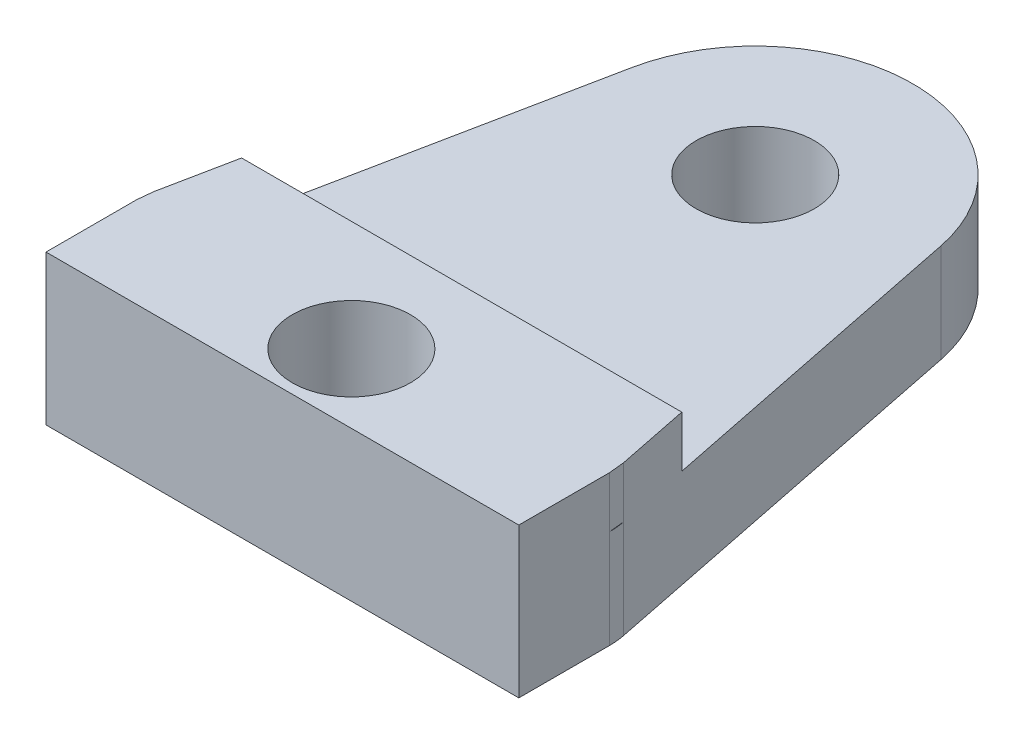
ISO-10303-21;
HEADER;
FILE_DESCRIPTION(('STEP AP214'),'2;1');
FILE_NAME('part.step','',(''),(''),'','','');
FILE_SCHEMA(('AUTOMOTIVE_DESIGN { 1 0 10303 214 1 1 1 1 }'));
ENDSEC;
DATA;
#1=APPLICATION_CONTEXT('core data for automotive mechanical design processes');
#2=APPLICATION_PROTOCOL_DEFINITION('international standard','automotive_design',2000,#1);
#3=PRODUCT_CONTEXT('',#1,'mechanical');
#4=PRODUCT('Part','Part','',(#3));
#5=PRODUCT_RELATED_PRODUCT_CATEGORY('part','',(#4));
#6=PRODUCT_DEFINITION_FORMATION('','',#4);
#7=PRODUCT_DEFINITION_CONTEXT('part definition',#1,'design');
#8=PRODUCT_DEFINITION('design','',#6,#7);
#9=PRODUCT_DEFINITION_SHAPE('','',#8);
#10=(LENGTH_UNIT() NAMED_UNIT(*) SI_UNIT(.MILLI.,.METRE.));
#11=(NAMED_UNIT(*) PLANE_ANGLE_UNIT() SI_UNIT($,.RADIAN.));
#12=(NAMED_UNIT(*) SI_UNIT($,.STERADIAN.) SOLID_ANGLE_UNIT());
#13=UNCERTAINTY_MEASURE_WITH_UNIT(LENGTH_MEASURE(1.E-05),#10,'distance_accuracy_value','');
#14=(GEOMETRIC_REPRESENTATION_CONTEXT(3) GLOBAL_UNCERTAINTY_ASSIGNED_CONTEXT((#13)) GLOBAL_UNIT_ASSIGNED_CONTEXT((#10,
#11,#12)) REPRESENTATION_CONTEXT('',''));
#15=CARTESIAN_POINT('',(0.,0.,0.));
#16=DIRECTION('',(0.,0.,1.));
#17=DIRECTION('',(1.,0.,0.));
#18=AXIS2_PLACEMENT_3D('',#15,#16,#17);
#19=CARTESIAN_POINT('',(6.,2.5,-12.));
#20=DIRECTION('',(0.,1.,0.));
#21=DIRECTION('',(0.,0.,1.));
#22=AXIS2_PLACEMENT_3D('',#19,#20,#21);
#23=PLANE('',#22);
#24=DIRECTION('',(-1.,0.,0.));
#25=VECTOR('',#24,1.);
#26=CARTESIAN_POINT('',(0.414141414141416,2.5,-4.55));
#27=LINE('',#26,#25);
#28=CARTESIAN_POINT('',(11.5858585858586,2.5,-4.55));
#29=VERTEX_POINT('',#28);
#30=CARTESIAN_POINT('',(0.414141414141416,2.5,-4.55));
#31=VERTEX_POINT('',#30);
#32=EDGE_CURVE('E50',#29,#31,#27,.T.);
#33=ORIENTED_EDGE('',*,*,#32,.F.);
#34=DIRECTION('',(-0.198019801980198,0.,-0.98019801980198));
#35=VECTOR('',#34,1.);
#36=CARTESIAN_POINT('',(12.,2.5,-2.5));
#37=LINE('',#36,#35);
#38=CARTESIAN_POINT('',(9.92079207920792,2.5,-12.7920792079208));
#39=VERTEX_POINT('',#38);
#40=EDGE_CURVE('E167',#29,#39,#37,.T.);
#41=ORIENTED_EDGE('',*,*,#40,.T.);
#42=CARTESIAN_POINT('',(6.,2.5,-12.));
#43=DIRECTION('',(0.,1.,0.));
#44=DIRECTION('',(0.,0.,1.));
#45=AXIS2_PLACEMENT_3D('',#42,#43,#44);
#46=CIRCLE('',#45,4.);
#47=CARTESIAN_POINT('',(2.07920792079208,2.5,-12.7920792079208));
#48=VERTEX_POINT('',#47);
#49=EDGE_CURVE('E164',#39,#48,#46,.T.);
#50=ORIENTED_EDGE('',*,*,#49,.T.);
#51=DIRECTION('',(-0.198019801980198,0.,0.98019801980198));
#52=VECTOR('',#51,1.);
#53=CARTESIAN_POINT('',(2.07920792079208,2.5,-12.7920792079208));
#54=LINE('',#53,#52);
#55=EDGE_CURVE('E55',#48,#31,#54,.T.);
#56=ORIENTED_EDGE('',*,*,#55,.T.);
#57=EDGE_LOOP('',(#33,#41,#50,#56));
#58=FACE_BOUND('',#57,.T.);
#59=CARTESIAN_POINT('',(6.,2.5,-12.));
#60=DIRECTION('',(0.,1.,0.));
#61=DIRECTION('',(0.,0.,1.));
#62=AXIS2_PLACEMENT_3D('',#59,#60,#61);
#63=CIRCLE('',#62,1.5);
#64=CARTESIAN_POINT('',(6.,2.5,-10.5));
#65=VERTEX_POINT('',#64);
#66=EDGE_CURVE('E153',#65,#65,#63,.T.);
#67=ORIENTED_EDGE('',*,*,#66,.F.);
#68=EDGE_LOOP('',(#67));
#69=FACE_BOUND('',#68,.T.);
#70=ADVANCED_FACE('F33',(#58,#69),#23,.T.);
#71=DIRECTION('',(-0.099503719020999,0.,-0.995037190209989));
#72=VECTOR('',#71,1.);
#73=CARTESIAN_POINT('',(12.,2.5,-2.3));
#74=LINE('',#73,#72);
#75=CARTESIAN_POINT('',(12.,2.5,-2.3));
#76=VERTEX_POINT('',#75);
#77=CARTESIAN_POINT('',(11.960396039604,2.5,-2.6960396039604));
#78=VERTEX_POINT('',#77);
#79=EDGE_CURVE('E173',#76,#78,#74,.T.);
#80=ORIENTED_EDGE('',*,*,#79,.F.);
#81=CARTESIAN_POINT('',(10.,2.5,-2.3));
#82=DIRECTION('',(0.,1.,0.));
#83=DIRECTION('',(0.,0.,1.));
#84=AXIS2_PLACEMENT_3D('',#81,#82,#83);
#85=CIRCLE('',#84,2.);
#86=EDGE_CURVE('E203',#76,#78,#85,.T.);
#87=ORIENTED_EDGE('',*,*,#86,.T.);
#88=EDGE_LOOP('',(#80,#87));
#89=FACE_BOUND('',#88,.T.);
#90=ADVANCED_FACE('F288',(#89),#23,.T.);
#91=DIRECTION('',(-0.0995037190210002,0.,0.995037190209989));
#92=VECTOR('',#91,1.);
#93=CARTESIAN_POINT('',(0.0396039603960401,2.5,-2.69603960396039));
#94=LINE('',#93,#92);
#95=CARTESIAN_POINT('',(0.0396039603960401,2.5,-2.69603960396039));
#96=VERTEX_POINT('',#95);
#97=CARTESIAN_POINT('',(0.,2.5,-2.29999999999999));
#98=VERTEX_POINT('',#97);
#99=EDGE_CURVE('E255',#96,#98,#94,.T.);
#100=ORIENTED_EDGE('',*,*,#99,.F.);
#101=CARTESIAN_POINT('',(2.,2.5,-2.29999999999999));
#102=DIRECTION('',(0.,1.,0.));
#103=DIRECTION('',(0.,0.,1.));
#104=AXIS2_PLACEMENT_3D('',#101,#102,#103);
#105=CIRCLE('',#104,2.);
#106=EDGE_CURVE('E206',#96,#98,#105,.T.);
#107=ORIENTED_EDGE('',*,*,#106,.T.);
#108=EDGE_LOOP('',(#100,#107));
#109=FACE_BOUND('',#108,.T.);
#110=ADVANCED_FACE('F254',(#109),#23,.T.);
#111=CARTESIAN_POINT('',(6.,0.,-12.));
#112=DIRECTION('',(0.,1.,0.));
#113=DIRECTION('',(0.,0.,1.));
#114=AXIS2_PLACEMENT_3D('',#111,#112,#113);
#115=PLANE('',#114);
#116=CARTESIAN_POINT('',(6.,0.,-1.75));
#117=DIRECTION('',(0.,1.,0.));
#118=DIRECTION('',(0.,0.,1.));
#119=AXIS2_PLACEMENT_3D('',#116,#117,#118);
#120=CIRCLE('',#119,1.5);
#121=CARTESIAN_POINT('',(6.,0.,-0.25));
#122=VERTEX_POINT('',#121);
#123=EDGE_CURVE('E256',#122,#122,#120,.F.);
#124=ORIENTED_EDGE('',*,*,#123,.F.);
#125=EDGE_LOOP('',(#124));
#126=FACE_BOUND('',#125,.T.);
#127=DIRECTION('',(0.,0.,1.));
#128=VECTOR('',#127,1.);
#129=CARTESIAN_POINT('',(0.,0.,0.));
#130=LINE('',#129,#128);
#131=CARTESIAN_POINT('',(0.,0.,-2.29999999999999));
#132=VERTEX_POINT('',#131);
#133=CARTESIAN_POINT('',(0.,0.,0.));
#134=VERTEX_POINT('',#133);
#135=EDGE_CURVE('E160',#132,#134,#130,.T.);
#136=ORIENTED_EDGE('',*,*,#135,.F.);
#137=CARTESIAN_POINT('',(2.,0.,-2.29999999999999));
#138=DIRECTION('',(0.,1.,0.));
#139=DIRECTION('',(0.,0.,1.));
#140=AXIS2_PLACEMENT_3D('',#137,#138,#139);
#141=CIRCLE('',#140,2.);
#142=CARTESIAN_POINT('',(0.0396039603960401,0.,-2.69603960396039));
#143=VERTEX_POINT('',#142);
#144=EDGE_CURVE('E210',#132,#143,#141,.F.);
#145=ORIENTED_EDGE('',*,*,#144,.T.);
#146=DIRECTION('',(-0.198019801980198,0.,0.98019801980198));
#147=VECTOR('',#146,1.);
#148=CARTESIAN_POINT('',(2.07920792079208,0.,-12.7920792079208));
#149=LINE('',#148,#147);
#150=CARTESIAN_POINT('',(2.07920792079208,0.,-12.7920792079208));
#151=VERTEX_POINT('',#150);
#152=EDGE_CURVE('E170',#151,#143,#149,.T.);
#153=ORIENTED_EDGE('',*,*,#152,.F.);
#154=CARTESIAN_POINT('',(6.,0.,-12.));
#155=DIRECTION('',(0.,1.,0.));
#156=DIRECTION('',(0.,0.,1.));
#157=AXIS2_PLACEMENT_3D('',#154,#155,#156);
#158=CIRCLE('',#157,4.);
#159=CARTESIAN_POINT('',(9.92079207920792,0.,-12.7920792079208));
#160=VERTEX_POINT('',#159);
#161=EDGE_CURVE('E228',#160,#151,#158,.T.);
#162=ORIENTED_EDGE('',*,*,#161,.F.);
#163=DIRECTION('',(-0.198019801980198,0.,-0.98019801980198));
#164=VECTOR('',#163,1.);
#165=CARTESIAN_POINT('',(12.,0.,-2.5));
#166=LINE('',#165,#164);
#167=CARTESIAN_POINT('',(11.960396039604,0.,-2.6960396039604));
#168=VERTEX_POINT('',#167);
#169=EDGE_CURVE('E218',#168,#160,#166,.T.);
#170=ORIENTED_EDGE('',*,*,#169,.F.);
#171=CARTESIAN_POINT('',(10.,0.,-2.3));
#172=DIRECTION('',(0.,1.,0.));
#173=DIRECTION('',(0.,0.,1.));
#174=AXIS2_PLACEMENT_3D('',#171,#172,#173);
#175=CIRCLE('',#174,2.);
#176=CARTESIAN_POINT('',(12.,0.,-2.3));
#177=VERTEX_POINT('',#176);
#178=EDGE_CURVE('E226',#168,#177,#175,.F.);
#179=ORIENTED_EDGE('',*,*,#178,.T.);
#180=DIRECTION('',(0.,0.,-1.));
#181=VECTOR('',#180,1.);
#182=CARTESIAN_POINT('',(12.,0.,0.));
#183=LINE('',#182,#181);
#184=CARTESIAN_POINT('',(12.,0.,0.));
#185=VERTEX_POINT('',#184);
#186=EDGE_CURVE('E200',#185,#177,#183,.T.);
#187=ORIENTED_EDGE('',*,*,#186,.F.);
#188=DIRECTION('',(1.,0.,0.));
#189=VECTOR('',#188,1.);
#190=CARTESIAN_POINT('',(0.,0.,0.));
#191=LINE('',#190,#189);
#192=EDGE_CURVE('E231',#134,#185,#191,.T.);
#193=ORIENTED_EDGE('',*,*,#192,.F.);
#194=EDGE_LOOP('',(#136,#145,#153,#162,#170,#179,#187,#193));
#195=FACE_BOUND('',#194,.T.);
#196=CARTESIAN_POINT('',(6.,0.,-12.));
#197=DIRECTION('',(0.,1.,0.));
#198=DIRECTION('',(0.,0.,1.));
#199=AXIS2_PLACEMENT_3D('',#196,#197,#198);
#200=CIRCLE('',#199,1.5);
#201=CARTESIAN_POINT('',(6.,0.,-10.5));
#202=VERTEX_POINT('',#201);
#203=EDGE_CURVE('E150',#202,#202,#200,.T.);
#204=ORIENTED_EDGE('',*,*,#203,.T.);
#205=EDGE_LOOP('',(#204));
#206=FACE_BOUND('',#205,.T.);
#207=ADVANCED_FACE('F224',(#126,#195,#206),#115,.F.);
#208=CARTESIAN_POINT('',(0.,2.5,0.));
#209=DIRECTION('',(1.,0.,0.));
#210=DIRECTION('',(0.,0.,-1.));
#211=AXIS2_PLACEMENT_3D('',#208,#209,#210);
#212=PLANE('',#211);
#213=DIRECTION('',(0.,-1.,0.));
#214=VECTOR('',#213,1.);
#215=CARTESIAN_POINT('',(0.,2.5,0.));
#216=LINE('',#215,#214);
#217=CARTESIAN_POINT('',(0.,3.8,0.));
#218=VERTEX_POINT('',#217);
#219=EDGE_CURVE('E243',#218,#134,#216,.T.);
#220=ORIENTED_EDGE('',*,*,#219,.F.);
#221=DIRECTION('',(0.,0.,1.));
#222=VECTOR('',#221,1.);
#223=CARTESIAN_POINT('',(0.,3.8,-2.29999999999999));
#224=LINE('',#223,#222);
#225=CARTESIAN_POINT('',(0.,3.8,-2.29999999999999));
#226=VERTEX_POINT('',#225);
#227=EDGE_CURVE('E133',#226,#218,#224,.T.);
#228=ORIENTED_EDGE('',*,*,#227,.F.);
#229=DIRECTION('',(0.,-1.,0.));
#230=VECTOR('',#229,1.);
#231=CARTESIAN_POINT('',(0.,3.8,-2.29999999999999));
#232=LINE('',#231,#230);
#233=EDGE_CURVE('E129',#226,#98,#232,.T.);
#234=ORIENTED_EDGE('',*,*,#233,.T.);
#235=DIRECTION('',(0.,-1.,0.));
#236=VECTOR('',#235,1.);
#237=CARTESIAN_POINT('',(0.,2.5,-2.29999999999999));
#238=LINE('',#237,#236);
#239=EDGE_CURVE('E246',#98,#132,#238,.T.);
#240=ORIENTED_EDGE('',*,*,#239,.T.);
#241=ORIENTED_EDGE('',*,*,#135,.T.);
#242=EDGE_LOOP('',(#220,#228,#234,#240,#241));
#243=FACE_BOUND('',#242,.T.);
#244=ADVANCED_FACE('F258',(#243),#212,.F.);
#245=CARTESIAN_POINT('',(0.,2.5,0.));
#246=DIRECTION('',(0.,0.,-1.));
#247=DIRECTION('',(-1.,0.,0.));
#248=AXIS2_PLACEMENT_3D('',#245,#246,#247);
#249=PLANE('',#248);
#250=ORIENTED_EDGE('',*,*,#192,.T.);
#251=DIRECTION('',(0.,-1.,0.));
#252=VECTOR('',#251,1.);
#253=CARTESIAN_POINT('',(12.,2.5,0.));
#254=LINE('',#253,#252);
#255=CARTESIAN_POINT('',(12.,3.8,0.));
#256=VERTEX_POINT('',#255);
#257=EDGE_CURVE('E241',#256,#185,#254,.T.);
#258=ORIENTED_EDGE('',*,*,#257,.F.);
#259=DIRECTION('',(1.,0.,0.));
#260=VECTOR('',#259,1.);
#261=CARTESIAN_POINT('',(0.,3.8,0.));
#262=LINE('',#261,#260);
#263=EDGE_CURVE('E261',#218,#256,#262,.T.);
#264=ORIENTED_EDGE('',*,*,#263,.F.);
#265=ORIENTED_EDGE('',*,*,#219,.T.);
#266=EDGE_LOOP('',(#250,#258,#264,#265));
#267=FACE_BOUND('',#266,.T.);
#268=ADVANCED_FACE('F305',(#267),#249,.F.);
#269=CARTESIAN_POINT('',(12.,2.5,0.));
#270=DIRECTION('',(-1.,0.,0.));
#271=DIRECTION('',(0.,0.,1.));
#272=AXIS2_PLACEMENT_3D('',#269,#270,#271);
#273=PLANE('',#272);
#274=ORIENTED_EDGE('',*,*,#186,.T.);
#275=DIRECTION('',(0.,-1.,0.));
#276=VECTOR('',#275,1.);
#277=CARTESIAN_POINT('',(12.,2.5,-2.3));
#278=LINE('',#277,#276);
#279=EDGE_CURVE('E11',#177,#76,#278,.F.);
#280=ORIENTED_EDGE('',*,*,#279,.T.);
#281=DIRECTION('',(0.,-1.,0.));
#282=VECTOR('',#281,1.);
#283=CARTESIAN_POINT('',(12.,3.8,-2.3));
#284=LINE('',#283,#282);
#285=CARTESIAN_POINT('',(12.,3.8,-2.3));
#286=VERTEX_POINT('',#285);
#287=EDGE_CURVE('E155',#286,#76,#284,.T.);
#288=ORIENTED_EDGE('',*,*,#287,.F.);
#289=DIRECTION('',(0.,0.,-1.));
#290=VECTOR('',#289,1.);
#291=CARTESIAN_POINT('',(12.,3.8,0.));
#292=LINE('',#291,#290);
#293=EDGE_CURVE('E196',#256,#286,#292,.T.);
#294=ORIENTED_EDGE('',*,*,#293,.F.);
#295=ORIENTED_EDGE('',*,*,#257,.T.);
#296=EDGE_LOOP('',(#274,#280,#288,#294,#295));
#297=FACE_BOUND('',#296,.T.);
#298=ADVANCED_FACE('F194',(#297),#273,.F.);
#299=CARTESIAN_POINT('',(12.,2.5,-2.5));
#300=DIRECTION('',(-0.98019801980198,0.,0.198019801980198));
#301=DIRECTION('',(0.198019801980198,0.,0.98019801980198));
#302=AXIS2_PLACEMENT_3D('',#299,#300,#301);
#303=PLANE('',#302);
#304=ORIENTED_EDGE('',*,*,#40,.F.);
#305=DIRECTION('',(0.,-1.,0.));
#306=VECTOR('',#305,1.);
#307=CARTESIAN_POINT('',(11.5858585858586,3.8,-4.55));
#308=LINE('',#307,#306);
#309=CARTESIAN_POINT('',(11.5858585858586,3.8,-4.55));
#310=VERTEX_POINT('',#309);
#311=EDGE_CURVE('E182',#310,#29,#308,.T.);
#312=ORIENTED_EDGE('',*,*,#311,.F.);
#313=DIRECTION('',(-0.198019801980198,0.,-0.98019801980198));
#314=VECTOR('',#313,1.);
#315=CARTESIAN_POINT('',(11.960396039604,3.8,-2.6960396039604));
#316=LINE('',#315,#314);
#317=CARTESIAN_POINT('',(11.960396039604,3.8,-2.6960396039604));
#318=VERTEX_POINT('',#317);
#319=EDGE_CURVE('E267',#318,#310,#316,.T.);
#320=ORIENTED_EDGE('',*,*,#319,.F.);
#321=DIRECTION('',(0.,-1.,0.));
#322=VECTOR('',#321,1.);
#323=CARTESIAN_POINT('',(11.960396039604,3.8,-2.6960396039604));
#324=LINE('',#323,#322);
#325=EDGE_CURVE('E180',#318,#78,#324,.T.);
#326=ORIENTED_EDGE('',*,*,#325,.T.);
#327=DIRECTION('',(0.,-1.,0.));
#328=VECTOR('',#327,1.);
#329=CARTESIAN_POINT('',(11.960396039604,2.5,-2.6960396039604));
#330=LINE('',#329,#328);
#331=EDGE_CURVE('E42',#78,#168,#330,.T.);
#332=ORIENTED_EDGE('',*,*,#331,.T.);
#333=ORIENTED_EDGE('',*,*,#169,.T.);
#334=DIRECTION('',(0.,-1.,0.));
#335=VECTOR('',#334,1.);
#336=CARTESIAN_POINT('',(9.92079207920792,2.5,-12.7920792079208));
#337=LINE('',#336,#335);
#338=EDGE_CURVE('E239',#39,#160,#337,.T.);
#339=ORIENTED_EDGE('',*,*,#338,.F.);
#340=EDGE_LOOP('',(#304,#312,#320,#326,#332,#333,#339));
#341=FACE_BOUND('',#340,.T.);
#342=ADVANCED_FACE('F216',(#341),#303,.F.);
#343=CARTESIAN_POINT('',(6.,2.5,-12.));
#344=DIRECTION('',(0.,-1.,0.));
#345=DIRECTION('',(0.,0.,-1.));
#346=AXIS2_PLACEMENT_3D('',#343,#344,#345);
#347=CYLINDRICAL_SURFACE('',#346,4.);
#348=ORIENTED_EDGE('',*,*,#161,.T.);
#349=DIRECTION('',(0.,-1.,0.));
#350=VECTOR('',#349,1.);
#351=CARTESIAN_POINT('',(2.07920792079208,2.5,-12.7920792079208));
#352=LINE('',#351,#350);
#353=EDGE_CURVE('E236',#48,#151,#352,.T.);
#354=ORIENTED_EDGE('',*,*,#353,.F.);
#355=ORIENTED_EDGE('',*,*,#49,.F.);
#356=ORIENTED_EDGE('',*,*,#338,.T.);
#357=EDGE_LOOP('',(#348,#354,#355,#356));
#358=FACE_BOUND('',#357,.T.);
#359=ADVANCED_FACE('F277',(#358),#347,.T.);
#360=CARTESIAN_POINT('',(2.07920792079208,2.5,-12.7920792079208));
#361=DIRECTION('',(0.98019801980198,0.,0.198019801980198));
#362=DIRECTION('',(0.198019801980198,0.,-0.98019801980198));
#363=AXIS2_PLACEMENT_3D('',#360,#361,#362);
#364=PLANE('',#363);
#365=ORIENTED_EDGE('',*,*,#152,.T.);
#366=DIRECTION('',(0.,-1.,0.));
#367=VECTOR('',#366,1.);
#368=CARTESIAN_POINT('',(0.0396039603960401,2.5,-2.69603960396039));
#369=LINE('',#368,#367);
#370=EDGE_CURVE('E148',#143,#96,#369,.F.);
#371=ORIENTED_EDGE('',*,*,#370,.T.);
#372=DIRECTION('',(0.,-1.,0.));
#373=VECTOR('',#372,1.);
#374=CARTESIAN_POINT('',(0.0396039603960401,3.8,-2.69603960396039));
#375=LINE('',#374,#373);
#376=CARTESIAN_POINT('',(0.0396039603960401,3.8,-2.69603960396039));
#377=VERTEX_POINT('',#376);
#378=EDGE_CURVE('E127',#377,#96,#375,.T.);
#379=ORIENTED_EDGE('',*,*,#378,.F.);
#380=DIRECTION('',(-0.198019801980198,0.,0.98019801980198));
#381=VECTOR('',#380,1.);
#382=CARTESIAN_POINT('',(0.414141414141416,3.8,-4.55));
#383=LINE('',#382,#381);
#384=CARTESIAN_POINT('',(0.414141414141416,3.8,-4.55));
#385=VERTEX_POINT('',#384);
#386=EDGE_CURVE('E134',#385,#377,#383,.T.);
#387=ORIENTED_EDGE('',*,*,#386,.F.);
#388=DIRECTION('',(0.,-1.,0.));
#389=VECTOR('',#388,1.);
#390=CARTESIAN_POINT('',(0.414141414141416,3.8,-4.55));
#391=LINE('',#390,#389);
#392=EDGE_CURVE('E174',#385,#31,#391,.T.);
#393=ORIENTED_EDGE('',*,*,#392,.T.);
#394=ORIENTED_EDGE('',*,*,#55,.F.);
#395=ORIENTED_EDGE('',*,*,#353,.T.);
#396=EDGE_LOOP('',(#365,#371,#379,#387,#393,#394,#395));
#397=FACE_BOUND('',#396,.T.);
#398=ADVANCED_FACE('F146',(#397),#364,.F.);
#399=CARTESIAN_POINT('',(6.,2.5,-12.));
#400=DIRECTION('',(0.,-1.,0.));
#401=DIRECTION('',(0.,0.,-1.));
#402=AXIS2_PLACEMENT_3D('',#399,#400,#401);
#403=CYLINDRICAL_SURFACE('',#402,1.5);
#404=ORIENTED_EDGE('',*,*,#66,.T.);
#405=EDGE_LOOP('',(#404));
#406=FACE_BOUND('',#405,.T.);
#407=ORIENTED_EDGE('',*,*,#203,.F.);
#408=EDGE_LOOP('',(#407));
#409=FACE_BOUND('',#408,.T.);
#410=ADVANCED_FACE('F284',(#406,#409),#403,.F.);
#411=CARTESIAN_POINT('',(2.,2.5,-2.29999999999999));
#412=DIRECTION('',(0.,-1.,0.));
#413=DIRECTION('',(0.,0.,-1.));
#414=AXIS2_PLACEMENT_3D('',#411,#412,#413);
#415=CYLINDRICAL_SURFACE('',#414,2.);
#416=ORIENTED_EDGE('',*,*,#106,.F.);
#417=ORIENTED_EDGE('',*,*,#370,.F.);
#418=ORIENTED_EDGE('',*,*,#144,.F.);
#419=ORIENTED_EDGE('',*,*,#239,.F.);
#420=EDGE_LOOP('',(#416,#417,#418,#419));
#421=FACE_BOUND('',#420,.T.);
#422=ADVANCED_FACE('F252',(#421),#415,.T.);
#423=CARTESIAN_POINT('',(10.,2.5,-2.3));
#424=DIRECTION('',(0.,-1.,0.));
#425=DIRECTION('',(0.,0.,-1.));
#426=AXIS2_PLACEMENT_3D('',#423,#424,#425);
#427=CYLINDRICAL_SURFACE('',#426,2.);
#428=ORIENTED_EDGE('',*,*,#86,.F.);
#429=ORIENTED_EDGE('',*,*,#279,.F.);
#430=ORIENTED_EDGE('',*,*,#178,.F.);
#431=ORIENTED_EDGE('',*,*,#331,.F.);
#432=EDGE_LOOP('',(#428,#429,#430,#431));
#433=FACE_BOUND('',#432,.T.);
#434=ADVANCED_FACE('F35',(#433),#427,.T.);
#435=CARTESIAN_POINT('',(0.0396039603960401,3.8,-2.69603960396039));
#436=DIRECTION('',(0.995037190209989,0.,0.0995037190210002));
#437=DIRECTION('',(0.0995037190210002,0.,-0.995037190209989));
#438=AXIS2_PLACEMENT_3D('',#435,#436,#437);
#439=PLANE('',#438);
#440=ORIENTED_EDGE('',*,*,#99,.T.);
#441=ORIENTED_EDGE('',*,*,#233,.F.);
#442=DIRECTION('',(-0.0995037190210002,0.,0.995037190209989));
#443=VECTOR('',#442,1.);
#444=CARTESIAN_POINT('',(0.0396039603960401,3.8,-2.69603960396039));
#445=LINE('',#444,#443);
#446=EDGE_CURVE('E122',#377,#226,#445,.T.);
#447=ORIENTED_EDGE('',*,*,#446,.F.);
#448=ORIENTED_EDGE('',*,*,#378,.T.);
#449=EDGE_LOOP('',(#440,#441,#447,#448));
#450=FACE_BOUND('',#449,.T.);
#451=ADVANCED_FACE('F125',(#450),#439,.F.);
#452=CARTESIAN_POINT('',(12.,3.8,-2.3));
#453=DIRECTION('',(-0.995037190209989,0.,0.099503719020999));
#454=DIRECTION('',(0.099503719020999,0.,0.995037190209989));
#455=AXIS2_PLACEMENT_3D('',#452,#453,#454);
#456=PLANE('',#455);
#457=ORIENTED_EDGE('',*,*,#79,.T.);
#458=ORIENTED_EDGE('',*,*,#325,.F.);
#459=DIRECTION('',(-0.099503719020999,0.,-0.995037190209989));
#460=VECTOR('',#459,1.);
#461=CARTESIAN_POINT('',(12.,3.8,-2.3));
#462=LINE('',#461,#460);
#463=EDGE_CURVE('E190',#286,#318,#462,.T.);
#464=ORIENTED_EDGE('',*,*,#463,.F.);
#465=ORIENTED_EDGE('',*,*,#287,.T.);
#466=EDGE_LOOP('',(#457,#458,#464,#465));
#467=FACE_BOUND('',#466,.T.);
#468=ADVANCED_FACE('F188',(#467),#456,.F.);
#469=CARTESIAN_POINT('',(0.414141414141416,3.8,-4.55));
#470=DIRECTION('',(0.,0.,1.));
#471=DIRECTION('',(1.,0.,0.));
#472=AXIS2_PLACEMENT_3D('',#469,#470,#471);
#473=PLANE('',#472);
#474=ORIENTED_EDGE('',*,*,#32,.T.);
#475=ORIENTED_EDGE('',*,*,#392,.F.);
#476=DIRECTION('',(-1.,0.,0.));
#477=VECTOR('',#476,1.);
#478=CARTESIAN_POINT('',(0.414141414141416,3.8,-4.55));
#479=LINE('',#478,#477);
#480=EDGE_CURVE('E139',#310,#385,#479,.T.);
#481=ORIENTED_EDGE('',*,*,#480,.F.);
#482=ORIENTED_EDGE('',*,*,#311,.T.);
#483=EDGE_LOOP('',(#474,#475,#481,#482));
#484=FACE_BOUND('',#483,.T.);
#485=ADVANCED_FACE('F273',(#484),#473,.F.);
#486=CARTESIAN_POINT('',(0.,3.8,0.));
#487=DIRECTION('',(0.,1.,0.));
#488=DIRECTION('',(0.,0.,1.));
#489=AXIS2_PLACEMENT_3D('',#486,#487,#488);
#490=PLANE('',#489);
#491=CARTESIAN_POINT('',(6.,3.8,-1.75));
#492=DIRECTION('',(0.,1.,0.));
#493=DIRECTION('',(0.,0.,1.));
#494=AXIS2_PLACEMENT_3D('',#491,#492,#493);
#495=CIRCLE('',#494,1.5);
#496=CARTESIAN_POINT('',(6.,3.8,-0.25));
#497=VERTEX_POINT('',#496);
#498=EDGE_CURVE('E310',#497,#497,#495,.T.);
#499=ORIENTED_EDGE('',*,*,#498,.F.);
#500=EDGE_LOOP('',(#499));
#501=FACE_BOUND('',#500,.T.);
#502=ORIENTED_EDGE('',*,*,#386,.T.);
#503=ORIENTED_EDGE('',*,*,#446,.T.);
#504=ORIENTED_EDGE('',*,*,#227,.T.);
#505=ORIENTED_EDGE('',*,*,#263,.T.);
#506=ORIENTED_EDGE('',*,*,#293,.T.);
#507=ORIENTED_EDGE('',*,*,#463,.T.);
#508=ORIENTED_EDGE('',*,*,#319,.T.);
#509=ORIENTED_EDGE('',*,*,#480,.T.);
#510=EDGE_LOOP('',(#502,#503,#504,#505,#506,#507,#508,#509));
#511=FACE_BOUND('',#510,.T.);
#512=ADVANCED_FACE('F137',(#501,#511),#490,.T.);
#513=CARTESIAN_POINT('',(6.,-4.24264068711928,-1.75));
#514=DIRECTION('',(0.,1.,0.));
#515=DIRECTION('',(0.,0.,1.));
#516=AXIS2_PLACEMENT_3D('',#513,#514,#515);
#517=CYLINDRICAL_SURFACE('',#516,1.5);
#518=ORIENTED_EDGE('',*,*,#123,.T.);
#519=EDGE_LOOP('',(#518));
#520=FACE_BOUND('',#519,.T.);
#521=ORIENTED_EDGE('',*,*,#498,.T.);
#522=EDGE_LOOP('',(#521));
#523=FACE_BOUND('',#522,.T.);
#524=ADVANCED_FACE('F316',(#520,#523),#517,.F.);
#525=CLOSED_SHELL('',(#70,#90,#110,#207,#244,#268,#298,#342,#359,#398,#410,#422,#434,#451,#468,
#485,#512,#524));
#526=MANIFOLD_SOLID_BREP('B2',#525);
#527=ADVANCED_BREP_SHAPE_REPRESENTATION('',(#18,#526),#14);
#528=SHAPE_DEFINITION_REPRESENTATION(#9,#527);
ENDSEC;
END-ISO-10303-21;
